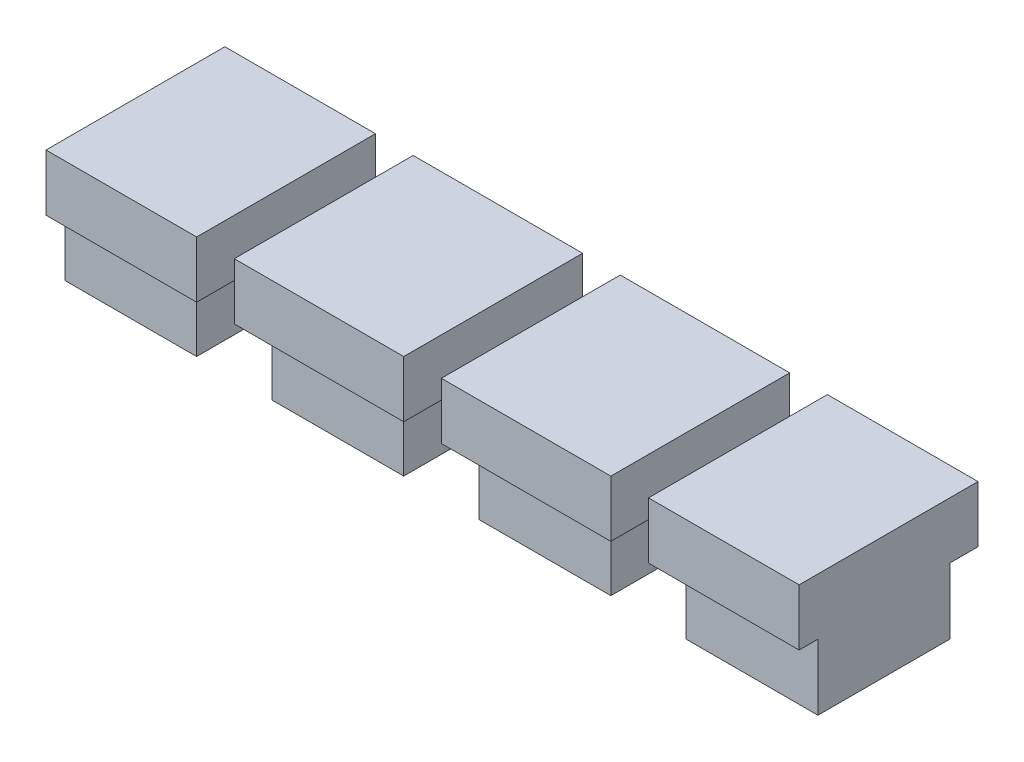
ISO-10303-21;
HEADER;
FILE_DESCRIPTION(('STEP AP214'),'2;1');
FILE_NAME('part.step','',(''),(''),'','','');
FILE_SCHEMA(('AUTOMOTIVE_DESIGN { 1 0 10303 214 1 1 1 1 }'));
ENDSEC;
DATA;
#1=APPLICATION_CONTEXT('core data for automotive mechanical design processes');
#2=APPLICATION_PROTOCOL_DEFINITION('international standard','automotive_design',2000,#1);
#3=PRODUCT_CONTEXT('',#1,'mechanical');
#4=PRODUCT('Part','Part','',(#3));
#5=PRODUCT_RELATED_PRODUCT_CATEGORY('part','',(#4));
#6=PRODUCT_DEFINITION_FORMATION('','',#4);
#7=PRODUCT_DEFINITION_CONTEXT('part definition',#1,'design');
#8=PRODUCT_DEFINITION('design','',#6,#7);
#9=PRODUCT_DEFINITION_SHAPE('','',#8);
#10=(LENGTH_UNIT() NAMED_UNIT(*) SI_UNIT(.MILLI.,.METRE.));
#11=(NAMED_UNIT(*) PLANE_ANGLE_UNIT() SI_UNIT($,.RADIAN.));
#12=(NAMED_UNIT(*) SI_UNIT($,.STERADIAN.) SOLID_ANGLE_UNIT());
#13=UNCERTAINTY_MEASURE_WITH_UNIT(LENGTH_MEASURE(1.E-05),#10,'distance_accuracy_value','');
#14=(GEOMETRIC_REPRESENTATION_CONTEXT(3) GLOBAL_UNCERTAINTY_ASSIGNED_CONTEXT((#13)) GLOBAL_UNIT_ASSIGNED_CONTEXT((#10,
#11,#12)) REPRESENTATION_CONTEXT('',''));
#15=CARTESIAN_POINT('',(0.,0.,0.));
#16=DIRECTION('',(0.,0.,1.));
#17=DIRECTION('',(1.,0.,0.));
#18=AXIS2_PLACEMENT_3D('',#15,#16,#17);
#19=CARTESIAN_POINT('',(0.,72.5,0.));
#20=DIRECTION('',(0.,1.,0.));
#21=DIRECTION('',(0.,0.,1.));
#22=AXIS2_PLACEMENT_3D('',#19,#20,#21);
#23=PLANE('',#22);
#24=DIRECTION('',(1.,0.,0.));
#25=VECTOR('',#24,1.);
#26=CARTESIAN_POINT('',(23.15,72.5,24.95));
#27=LINE('',#26,#25);
#28=CARTESIAN_POINT('',(15.15,72.5,24.95));
#29=VERTEX_POINT('',#28);
#30=CARTESIAN_POINT('',(23.15,72.5,24.95));
#31=VERTEX_POINT('',#30);
#32=EDGE_CURVE('E164',#29,#31,#27,.T.);
#33=ORIENTED_EDGE('',*,*,#32,.F.);
#34=DIRECTION('',(0.,0.,1.));
#35=VECTOR('',#34,1.);
#36=CARTESIAN_POINT('',(15.15,72.5,24.95));
#37=LINE('',#36,#35);
#38=CARTESIAN_POINT('',(15.15,72.5,23.95));
#39=VERTEX_POINT('',#38);
#40=EDGE_CURVE('E89',#39,#29,#37,.T.);
#41=ORIENTED_EDGE('',*,*,#40,.F.);
#42=DIRECTION('',(1.,0.,0.));
#43=VECTOR('',#42,1.);
#44=CARTESIAN_POINT('',(23.15,72.5,23.95));
#45=LINE('',#44,#43);
#46=CARTESIAN_POINT('',(22.15,72.5,23.95));
#47=VERTEX_POINT('',#46);
#48=EDGE_CURVE('E83',#39,#47,#45,.T.);
#49=ORIENTED_EDGE('',*,*,#48,.T.);
#50=DIRECTION('',(0.,0.,1.));
#51=VECTOR('',#50,1.);
#52=CARTESIAN_POINT('',(22.15,72.5,16.95));
#53=LINE('',#52,#51);
#54=CARTESIAN_POINT('',(22.15,72.5,16.95));
#55=VERTEX_POINT('',#54);
#56=EDGE_CURVE('E162',#55,#47,#53,.T.);
#57=ORIENTED_EDGE('',*,*,#56,.F.);
#58=DIRECTION('',(1.,0.,0.));
#59=VECTOR('',#58,1.);
#60=CARTESIAN_POINT('',(15.15,72.5,16.95));
#61=LINE('',#60,#59);
#62=CARTESIAN_POINT('',(15.15,72.5,16.95));
#63=VERTEX_POINT('',#62);
#64=EDGE_CURVE('E157',#63,#55,#61,.T.);
#65=ORIENTED_EDGE('',*,*,#64,.F.);
#66=CARTESIAN_POINT('',(15.15,72.5,15.45));
#67=VERTEX_POINT('',#66);
#68=EDGE_CURVE('E140',#67,#63,#37,.T.);
#69=ORIENTED_EDGE('',*,*,#68,.F.);
#70=DIRECTION('',(-1.,0.,0.));
#71=VECTOR('',#70,1.);
#72=CARTESIAN_POINT('',(22.4,72.5,15.45));
#73=LINE('',#72,#71);
#74=CARTESIAN_POINT('',(23.15,72.5,15.45));
#75=VERTEX_POINT('',#74);
#76=EDGE_CURVE('E154',#75,#67,#73,.T.);
#77=ORIENTED_EDGE('',*,*,#76,.F.);
#78=DIRECTION('',(0.,0.,-1.));
#79=VECTOR('',#78,1.);
#80=CARTESIAN_POINT('',(23.15,72.5,23.95));
#81=LINE('',#80,#79);
#82=EDGE_CURVE('E194',#31,#75,#81,.T.);
#83=ORIENTED_EDGE('',*,*,#82,.F.);
#84=EDGE_LOOP('',(#33,#41,#49,#57,#65,#69,#77,#83));
#85=FACE_BOUND('',#84,.T.);
#86=ADVANCED_FACE('F76',(#85),#23,.F.);
#87=CARTESIAN_POINT('',(22.4,72.5,15.45));
#88=DIRECTION('',(0.,0.,-1.));
#89=DIRECTION('',(-1.,0.,0.));
#90=AXIS2_PLACEMENT_3D('',#87,#88,#89);
#91=PLANE('',#90);
#92=DIRECTION('',(0.,-1.,0.));
#93=VECTOR('',#92,1.);
#94=CARTESIAN_POINT('',(15.15,99.5,15.45));
#95=LINE('',#94,#93);
#96=CARTESIAN_POINT('',(15.15,75.5,15.45));
#97=VERTEX_POINT('',#96);
#98=EDGE_CURVE('E137',#97,#67,#95,.T.);
#99=ORIENTED_EDGE('',*,*,#98,.F.);
#100=DIRECTION('',(-1.,0.,0.));
#101=VECTOR('',#100,1.);
#102=CARTESIAN_POINT('',(0.,75.5,15.45));
#103=LINE('',#102,#101);
#104=CARTESIAN_POINT('',(23.15,75.5,15.45));
#105=VERTEX_POINT('',#104);
#106=EDGE_CURVE('E160',#105,#97,#103,.T.);
#107=ORIENTED_EDGE('',*,*,#106,.F.);
#108=DIRECTION('',(0.,-1.,0.));
#109=VECTOR('',#108,1.);
#110=CARTESIAN_POINT('',(23.15,82.5,15.45));
#111=LINE('',#110,#109);
#112=EDGE_CURVE('E98',#105,#75,#111,.T.);
#113=ORIENTED_EDGE('',*,*,#112,.T.);
#114=ORIENTED_EDGE('',*,*,#76,.T.);
#115=EDGE_LOOP('',(#99,#107,#113,#114));
#116=FACE_BOUND('',#115,.T.);
#117=ADVANCED_FACE('F159',(#116),#91,.T.);
#118=CARTESIAN_POINT('',(0.,75.5,0.));
#119=DIRECTION('',(0.,1.,0.));
#120=DIRECTION('',(0.,0.,1.));
#121=AXIS2_PLACEMENT_3D('',#118,#119,#120);
#122=PLANE('',#121);
#123=DIRECTION('',(0.,0.,-1.));
#124=VECTOR('',#123,1.);
#125=CARTESIAN_POINT('',(15.15,75.5,0.));
#126=LINE('',#125,#124);
#127=CARTESIAN_POINT('',(15.15,75.5,24.95));
#128=VERTEX_POINT('',#127);
#129=EDGE_CURVE('E143',#128,#97,#126,.T.);
#130=ORIENTED_EDGE('',*,*,#129,.F.);
#131=DIRECTION('',(-1.,0.,0.));
#132=VECTOR('',#131,1.);
#133=CARTESIAN_POINT('',(23.15,75.5,24.95));
#134=LINE('',#133,#132);
#135=CARTESIAN_POINT('',(23.15,75.5,24.95));
#136=VERTEX_POINT('',#135);
#137=EDGE_CURVE('E241',#136,#128,#134,.T.);
#138=ORIENTED_EDGE('',*,*,#137,.F.);
#139=DIRECTION('',(0.,0.,1.));
#140=VECTOR('',#139,1.);
#141=CARTESIAN_POINT('',(23.15,75.5,0.));
#142=LINE('',#141,#140);
#143=EDGE_CURVE('E182',#105,#136,#142,.T.);
#144=ORIENTED_EDGE('',*,*,#143,.F.);
#145=ORIENTED_EDGE('',*,*,#106,.T.);
#146=EDGE_LOOP('',(#130,#138,#144,#145));
#147=FACE_BOUND('',#146,.T.);
#148=ADVANCED_FACE('F216',(#147),#122,.T.);
#149=CARTESIAN_POINT('',(22.15,72.5,16.95));
#150=DIRECTION('',(1.,0.,0.));
#151=DIRECTION('',(0.,0.,-1.));
#152=AXIS2_PLACEMENT_3D('',#149,#150,#151);
#153=PLANE('',#152);
#154=DIRECTION('',(0.,0.,1.));
#155=VECTOR('',#154,1.);
#156=CARTESIAN_POINT('',(22.15,69.,16.95));
#157=LINE('',#156,#155);
#158=CARTESIAN_POINT('',(22.15,69.,16.95));
#159=VERTEX_POINT('',#158);
#160=CARTESIAN_POINT('',(22.15,69.,23.95));
#161=VERTEX_POINT('',#160);
#162=EDGE_CURVE('E174',#159,#161,#157,.T.);
#163=ORIENTED_EDGE('',*,*,#162,.F.);
#164=DIRECTION('',(0.,-1.,0.));
#165=VECTOR('',#164,1.);
#166=CARTESIAN_POINT('',(22.15,72.5,16.95));
#167=LINE('',#166,#165);
#168=EDGE_CURVE('E177',#55,#159,#167,.T.);
#169=ORIENTED_EDGE('',*,*,#168,.F.);
#170=ORIENTED_EDGE('',*,*,#56,.T.);
#171=DIRECTION('',(0.,-1.,0.));
#172=VECTOR('',#171,1.);
#173=CARTESIAN_POINT('',(22.15,72.5,23.95));
#174=LINE('',#173,#172);
#175=EDGE_CURVE('E169',#47,#161,#174,.T.);
#176=ORIENTED_EDGE('',*,*,#175,.T.);
#177=EDGE_LOOP('',(#163,#169,#170,#176));
#178=FACE_BOUND('',#177,.T.);
#179=ADVANCED_FACE('F206',(#178),#153,.T.);
#180=CARTESIAN_POINT('',(15.15,72.5,16.95));
#181=DIRECTION('',(0.,0.,-1.));
#182=DIRECTION('',(-1.,0.,0.));
#183=AXIS2_PLACEMENT_3D('',#180,#181,#182);
#184=PLANE('',#183);
#185=DIRECTION('',(1.,0.,0.));
#186=VECTOR('',#185,1.);
#187=CARTESIAN_POINT('',(15.15,69.,16.95));
#188=LINE('',#187,#186);
#189=CARTESIAN_POINT('',(15.15,69.,16.95));
#190=VERTEX_POINT('',#189);
#191=EDGE_CURVE('E179',#190,#159,#188,.T.);
#192=ORIENTED_EDGE('',*,*,#191,.F.);
#193=DIRECTION('',(0.,-1.,0.));
#194=VECTOR('',#193,1.);
#195=CARTESIAN_POINT('',(15.15,72.5,16.95));
#196=LINE('',#195,#194);
#197=EDGE_CURVE('E175',#63,#190,#196,.T.);
#198=ORIENTED_EDGE('',*,*,#197,.F.);
#199=ORIENTED_EDGE('',*,*,#64,.T.);
#200=ORIENTED_EDGE('',*,*,#168,.T.);
#201=EDGE_LOOP('',(#192,#198,#199,#200));
#202=FACE_BOUND('',#201,.T.);
#203=ADVANCED_FACE('F208',(#202),#184,.T.);
#204=CARTESIAN_POINT('',(15.15,72.5,16.95));
#205=DIRECTION('',(-1.,0.,0.));
#206=DIRECTION('',(0.,0.,1.));
#207=AXIS2_PLACEMENT_3D('',#204,#205,#206);
#208=PLANE('',#207);
#209=DIRECTION('',(0.,0.,-1.));
#210=VECTOR('',#209,1.);
#211=CARTESIAN_POINT('',(15.15,69.,16.95));
#212=LINE('',#211,#210);
#213=CARTESIAN_POINT('',(15.15,69.,23.95));
#214=VERTEX_POINT('',#213);
#215=EDGE_CURVE('E183',#214,#190,#212,.T.);
#216=ORIENTED_EDGE('',*,*,#215,.F.);
#217=DIRECTION('',(0.,-1.,0.));
#218=VECTOR('',#217,1.);
#219=CARTESIAN_POINT('',(15.15,72.5,23.95));
#220=LINE('',#219,#218);
#221=EDGE_CURVE('E171',#39,#214,#220,.T.);
#222=ORIENTED_EDGE('',*,*,#221,.F.);
#223=ORIENTED_EDGE('',*,*,#40,.T.);
#224=DIRECTION('',(0.,1.,0.));
#225=VECTOR('',#224,1.);
#226=CARTESIAN_POINT('',(15.15,0.,24.95));
#227=LINE('',#226,#225);
#228=EDGE_CURVE('E13',#29,#128,#227,.T.);
#229=ORIENTED_EDGE('',*,*,#228,.T.);
#230=ORIENTED_EDGE('',*,*,#129,.T.);
#231=ORIENTED_EDGE('',*,*,#98,.T.);
#232=ORIENTED_EDGE('',*,*,#68,.T.);
#233=ORIENTED_EDGE('',*,*,#197,.T.);
#234=EDGE_LOOP('',(#216,#222,#223,#229,#230,#231,#232,#233));
#235=FACE_BOUND('',#234,.T.);
#236=ADVANCED_FACE('F139',(#235),#208,.T.);
#237=CARTESIAN_POINT('',(15.15,72.5,23.95));
#238=DIRECTION('',(0.,0.,1.));
#239=DIRECTION('',(1.,0.,0.));
#240=AXIS2_PLACEMENT_3D('',#237,#238,#239);
#241=PLANE('',#240);
#242=ORIENTED_EDGE('',*,*,#48,.F.);
#243=ORIENTED_EDGE('',*,*,#221,.T.);
#244=DIRECTION('',(-1.,0.,0.));
#245=VECTOR('',#244,1.);
#246=CARTESIAN_POINT('',(15.15,69.,23.95));
#247=LINE('',#246,#245);
#248=EDGE_CURVE('E186',#161,#214,#247,.T.);
#249=ORIENTED_EDGE('',*,*,#248,.F.);
#250=ORIENTED_EDGE('',*,*,#175,.F.);
#251=EDGE_LOOP('',(#242,#243,#249,#250));
#252=FACE_BOUND('',#251,.T.);
#253=ADVANCED_FACE('F199',(#252),#241,.T.);
#254=CARTESIAN_POINT('',(0.,69.,0.));
#255=DIRECTION('',(0.,1.,0.));
#256=DIRECTION('',(0.,0.,1.));
#257=AXIS2_PLACEMENT_3D('',#254,#255,#256);
#258=PLANE('',#257);
#259=ORIENTED_EDGE('',*,*,#162,.T.);
#260=ORIENTED_EDGE('',*,*,#248,.T.);
#261=ORIENTED_EDGE('',*,*,#215,.T.);
#262=ORIENTED_EDGE('',*,*,#191,.T.);
#263=EDGE_LOOP('',(#259,#260,#261,#262));
#264=FACE_BOUND('',#263,.T.);
#265=ADVANCED_FACE('F203',(#264),#258,.F.);
#266=CARTESIAN_POINT('',(23.15,82.5,23.95));
#267=DIRECTION('',(-1.,0.,0.));
#268=DIRECTION('',(0.,0.,1.));
#269=AXIS2_PLACEMENT_3D('',#266,#267,#268);
#270=PLANE('',#269);
#271=ORIENTED_EDGE('',*,*,#143,.T.);
#272=DIRECTION('',(0.,1.,0.));
#273=VECTOR('',#272,1.);
#274=CARTESIAN_POINT('',(23.15,72.5,24.95));
#275=LINE('',#274,#273);
#276=EDGE_CURVE('E242',#31,#136,#275,.T.);
#277=ORIENTED_EDGE('',*,*,#276,.F.);
#278=ORIENTED_EDGE('',*,*,#82,.T.);
#279=ORIENTED_EDGE('',*,*,#112,.F.);
#280=EDGE_LOOP('',(#271,#277,#278,#279));
#281=FACE_BOUND('',#280,.T.);
#282=ADVANCED_FACE('F231',(#281),#270,.F.);
#283=CARTESIAN_POINT('',(0.,0.,24.95));
#284=DIRECTION('',(0.,0.,1.));
#285=DIRECTION('',(1.,0.,0.));
#286=AXIS2_PLACEMENT_3D('',#283,#284,#285);
#287=PLANE('',#286);
#288=ORIENTED_EDGE('',*,*,#228,.F.);
#289=ORIENTED_EDGE('',*,*,#32,.T.);
#290=ORIENTED_EDGE('',*,*,#276,.T.);
#291=ORIENTED_EDGE('',*,*,#137,.T.);
#292=EDGE_LOOP('',(#288,#289,#290,#291));
#293=FACE_BOUND('',#292,.T.);
#294=ADVANCED_FACE('F232',(#293),#287,.T.);
#295=CLOSED_SHELL('',(#86,#117,#148,#179,#203,#236,#253,#265,#282,#294));
#296=MANIFOLD_SOLID_BREP('B2',#295);
#297=CARTESIAN_POINT('',(48.15,72.5,16.95));
#298=DIRECTION('',(0.,0.,-1.));
#299=DIRECTION('',(-1.,0.,0.));
#300=AXIS2_PLACEMENT_3D('',#297,#298,#299);
#301=PLANE('',#300);
#302=DIRECTION('',(1.,0.,0.));
#303=VECTOR('',#302,1.);
#304=CARTESIAN_POINT('',(48.15,69.,16.95));
#305=LINE('',#304,#303);
#306=CARTESIAN_POINT('',(48.15,69.,16.95));
#307=VERTEX_POINT('',#306);
#308=CARTESIAN_POINT('',(55.15,69.,16.95));
#309=VERTEX_POINT('',#308);
#310=EDGE_CURVE('E539',#307,#309,#305,.T.);
#311=ORIENTED_EDGE('',*,*,#310,.F.);
#312=DIRECTION('',(0.,-1.,0.));
#313=VECTOR('',#312,1.);
#314=CARTESIAN_POINT('',(48.15,72.5,16.95));
#315=LINE('',#314,#313);
#316=CARTESIAN_POINT('',(48.15,72.5,16.95));
#317=VERTEX_POINT('',#316);
#318=EDGE_CURVE('E535',#317,#307,#315,.T.);
#319=ORIENTED_EDGE('',*,*,#318,.F.);
#320=DIRECTION('',(1.,0.,0.));
#321=VECTOR('',#320,1.);
#322=CARTESIAN_POINT('',(48.15,72.5,16.95));
#323=LINE('',#322,#321);
#324=CARTESIAN_POINT('',(55.15,72.5,16.95));
#325=VERTEX_POINT('',#324);
#326=EDGE_CURVE('E516',#317,#325,#323,.T.);
#327=ORIENTED_EDGE('',*,*,#326,.T.);
#328=DIRECTION('',(0.,-1.,0.));
#329=VECTOR('',#328,1.);
#330=CARTESIAN_POINT('',(55.15,72.5,16.95));
#331=LINE('',#330,#329);
#332=EDGE_CURVE('E532',#325,#309,#331,.T.);
#333=ORIENTED_EDGE('',*,*,#332,.T.);
#334=EDGE_LOOP('',(#311,#319,#327,#333));
#335=FACE_BOUND('',#334,.T.);
#336=ADVANCED_FACE('F430',(#335),#301,.T.);
#337=CARTESIAN_POINT('',(55.15,72.5,16.95));
#338=DIRECTION('',(1.,0.,0.));
#339=DIRECTION('',(0.,0.,-1.));
#340=AXIS2_PLACEMENT_3D('',#337,#338,#339);
#341=PLANE('',#340);
#342=DIRECTION('',(0.,0.,1.));
#343=VECTOR('',#342,1.);
#344=CARTESIAN_POINT('',(55.15,69.,16.95));
#345=LINE('',#344,#343);
#346=CARTESIAN_POINT('',(55.15,69.,23.95));
#347=VERTEX_POINT('',#346);
#348=EDGE_CURVE('E531',#309,#347,#345,.T.);
#349=ORIENTED_EDGE('',*,*,#348,.F.);
#350=ORIENTED_EDGE('',*,*,#332,.F.);
#351=DIRECTION('',(0.,0.,-1.));
#352=VECTOR('',#351,1.);
#353=CARTESIAN_POINT('',(55.15,72.5,24.95));
#354=LINE('',#353,#352);
#355=CARTESIAN_POINT('',(55.15,72.5,15.45));
#356=VERTEX_POINT('',#355);
#357=EDGE_CURVE('E509',#325,#356,#354,.T.);
#358=ORIENTED_EDGE('',*,*,#357,.T.);
#359=DIRECTION('',(0.,-1.,0.));
#360=VECTOR('',#359,1.);
#361=CARTESIAN_POINT('',(55.15,99.5,15.45));
#362=LINE('',#361,#360);
#363=CARTESIAN_POINT('',(55.15,75.5,15.45));
#364=VERTEX_POINT('',#363);
#365=EDGE_CURVE('E508',#364,#356,#362,.T.);
#366=ORIENTED_EDGE('',*,*,#365,.F.);
#367=DIRECTION('',(0.,0.,1.));
#368=VECTOR('',#367,1.);
#369=CARTESIAN_POINT('',(55.15,75.5,0.));
#370=LINE('',#369,#368);
#371=CARTESIAN_POINT('',(55.15,75.5,24.95));
#372=VERTEX_POINT('',#371);
#373=EDGE_CURVE('E445',#364,#372,#370,.T.);
#374=ORIENTED_EDGE('',*,*,#373,.T.);
#375=DIRECTION('',(0.,1.,0.));
#376=VECTOR('',#375,1.);
#377=CARTESIAN_POINT('',(55.15,0.,24.95));
#378=LINE('',#377,#376);
#379=CARTESIAN_POINT('',(55.15,72.5,24.95));
#380=VERTEX_POINT('',#379);
#381=EDGE_CURVE('E74',#380,#372,#378,.T.);
#382=ORIENTED_EDGE('',*,*,#381,.F.);
#383=CARTESIAN_POINT('',(55.15,72.5,23.95));
#384=VERTEX_POINT('',#383);
#385=EDGE_CURVE('E495',#380,#384,#354,.T.);
#386=ORIENTED_EDGE('',*,*,#385,.T.);
#387=DIRECTION('',(0.,-1.,0.));
#388=VECTOR('',#387,1.);
#389=CARTESIAN_POINT('',(55.15,72.5,23.95));
#390=LINE('',#389,#388);
#391=EDGE_CURVE('E529',#384,#347,#390,.T.);
#392=ORIENTED_EDGE('',*,*,#391,.T.);
#393=EDGE_LOOP('',(#349,#350,#358,#366,#374,#382,#386,#392));
#394=FACE_BOUND('',#393,.T.);
#395=ADVANCED_FACE('F494',(#394),#341,.T.);
#396=CARTESIAN_POINT('',(0.,69.,0.));
#397=DIRECTION('',(0.,1.,0.));
#398=DIRECTION('',(0.,0.,1.));
#399=AXIS2_PLACEMENT_3D('',#396,#397,#398);
#400=PLANE('',#399);
#401=ORIENTED_EDGE('',*,*,#348,.T.);
#402=DIRECTION('',(-1.,0.,0.));
#403=VECTOR('',#402,1.);
#404=CARTESIAN_POINT('',(48.15,69.,23.95));
#405=LINE('',#404,#403);
#406=CARTESIAN_POINT('',(48.15,69.,23.95));
#407=VERTEX_POINT('',#406);
#408=EDGE_CURVE('E545',#347,#407,#405,.T.);
#409=ORIENTED_EDGE('',*,*,#408,.T.);
#410=DIRECTION('',(0.,0.,-1.));
#411=VECTOR('',#410,1.);
#412=CARTESIAN_POINT('',(48.15,69.,16.95));
#413=LINE('',#412,#411);
#414=EDGE_CURVE('E542',#407,#307,#413,.T.);
#415=ORIENTED_EDGE('',*,*,#414,.T.);
#416=ORIENTED_EDGE('',*,*,#310,.T.);
#417=EDGE_LOOP('',(#401,#409,#415,#416));
#418=FACE_BOUND('',#417,.T.);
#419=ADVANCED_FACE('F582',(#418),#400,.F.);
#420=CARTESIAN_POINT('',(48.15,72.5,16.95));
#421=DIRECTION('',(-1.,0.,0.));
#422=DIRECTION('',(0.,0.,1.));
#423=AXIS2_PLACEMENT_3D('',#420,#421,#422);
#424=PLANE('',#423);
#425=ORIENTED_EDGE('',*,*,#414,.F.);
#426=DIRECTION('',(0.,-1.,0.));
#427=VECTOR('',#426,1.);
#428=CARTESIAN_POINT('',(48.15,72.5,23.95));
#429=LINE('',#428,#427);
#430=CARTESIAN_POINT('',(48.15,72.5,23.95));
#431=VERTEX_POINT('',#430);
#432=EDGE_CURVE('E528',#431,#407,#429,.T.);
#433=ORIENTED_EDGE('',*,*,#432,.F.);
#434=DIRECTION('',(0.,0.,-1.));
#435=VECTOR('',#434,1.);
#436=CARTESIAN_POINT('',(48.15,72.5,16.95));
#437=LINE('',#436,#435);
#438=EDGE_CURVE('E537',#431,#317,#437,.T.);
#439=ORIENTED_EDGE('',*,*,#438,.T.);
#440=ORIENTED_EDGE('',*,*,#318,.T.);
#441=EDGE_LOOP('',(#425,#433,#439,#440));
#442=FACE_BOUND('',#441,.T.);
#443=ADVANCED_FACE('F573',(#442),#424,.T.);
#444=CARTESIAN_POINT('',(15.15,72.5,23.95));
#445=DIRECTION('',(0.,0.,1.));
#446=DIRECTION('',(1.,0.,0.));
#447=AXIS2_PLACEMENT_3D('',#444,#445,#446);
#448=PLANE('',#447);
#449=DIRECTION('',(1.,0.,0.));
#450=VECTOR('',#449,1.);
#451=CARTESIAN_POINT('',(47.15,72.5,23.95));
#452=LINE('',#451,#450);
#453=EDGE_CURVE('E438',#431,#384,#452,.T.);
#454=ORIENTED_EDGE('',*,*,#453,.F.);
#455=ORIENTED_EDGE('',*,*,#432,.T.);
#456=ORIENTED_EDGE('',*,*,#408,.F.);
#457=ORIENTED_EDGE('',*,*,#391,.F.);
#458=EDGE_LOOP('',(#454,#455,#456,#457));
#459=FACE_BOUND('',#458,.T.);
#460=ADVANCED_FACE('F567',(#459),#448,.T.);
#461=CARTESIAN_POINT('',(0.,75.5,0.));
#462=DIRECTION('',(0.,1.,0.));
#463=DIRECTION('',(0.,0.,1.));
#464=AXIS2_PLACEMENT_3D('',#461,#462,#463);
#465=PLANE('',#464);
#466=ORIENTED_EDGE('',*,*,#373,.F.);
#467=DIRECTION('',(-1.,0.,0.));
#468=VECTOR('',#467,1.);
#469=CARTESIAN_POINT('',(0.,75.5,15.45));
#470=LINE('',#469,#468);
#471=CARTESIAN_POINT('',(47.15,75.5,15.45));
#472=VERTEX_POINT('',#471);
#473=EDGE_CURVE('E452',#364,#472,#470,.T.);
#474=ORIENTED_EDGE('',*,*,#473,.T.);
#475=DIRECTION('',(0.,0.,1.));
#476=VECTOR('',#475,1.);
#477=CARTESIAN_POINT('',(47.15,75.5,0.));
#478=LINE('',#477,#476);
#479=CARTESIAN_POINT('',(47.15,75.5,24.95));
#480=VERTEX_POINT('',#479);
#481=EDGE_CURVE('E526',#472,#480,#478,.T.);
#482=ORIENTED_EDGE('',*,*,#481,.T.);
#483=DIRECTION('',(-1.,0.,0.));
#484=VECTOR('',#483,1.);
#485=CARTESIAN_POINT('',(47.15,75.5,24.95));
#486=LINE('',#485,#484);
#487=EDGE_CURVE('E514',#372,#480,#486,.T.);
#488=ORIENTED_EDGE('',*,*,#487,.F.);
#489=EDGE_LOOP('',(#466,#474,#482,#488));
#490=FACE_BOUND('',#489,.T.);
#491=ADVANCED_FACE('F565',(#490),#465,.T.);
#492=CARTESIAN_POINT('',(56.65,72.5,15.45));
#493=DIRECTION('',(0.,0.,-1.));
#494=DIRECTION('',(-1.,0.,0.));
#495=AXIS2_PLACEMENT_3D('',#492,#493,#494);
#496=PLANE('',#495);
#497=ORIENTED_EDGE('',*,*,#365,.T.);
#498=DIRECTION('',(-1.,0.,0.));
#499=VECTOR('',#498,1.);
#500=CARTESIAN_POINT('',(56.65,72.5,15.45));
#501=LINE('',#500,#499);
#502=CARTESIAN_POINT('',(47.15,72.5,15.45));
#503=VERTEX_POINT('',#502);
#504=EDGE_CURVE('E523',#356,#503,#501,.T.);
#505=ORIENTED_EDGE('',*,*,#504,.T.);
#506=DIRECTION('',(0.,-1.,0.));
#507=VECTOR('',#506,1.);
#508=CARTESIAN_POINT('',(47.15,82.5,15.45));
#509=LINE('',#508,#507);
#510=EDGE_CURVE('E522',#472,#503,#509,.T.);
#511=ORIENTED_EDGE('',*,*,#510,.F.);
#512=ORIENTED_EDGE('',*,*,#473,.F.);
#513=EDGE_LOOP('',(#497,#505,#511,#512));
#514=FACE_BOUND('',#513,.T.);
#515=ADVANCED_FACE('F563',(#514),#496,.T.);
#516=CARTESIAN_POINT('',(0.,72.5,0.));
#517=DIRECTION('',(0.,1.,0.));
#518=DIRECTION('',(0.,0.,1.));
#519=AXIS2_PLACEMENT_3D('',#516,#517,#518);
#520=PLANE('',#519);
#521=ORIENTED_EDGE('',*,*,#504,.F.);
#522=ORIENTED_EDGE('',*,*,#357,.F.);
#523=ORIENTED_EDGE('',*,*,#326,.F.);
#524=ORIENTED_EDGE('',*,*,#438,.F.);
#525=ORIENTED_EDGE('',*,*,#453,.T.);
#526=ORIENTED_EDGE('',*,*,#385,.F.);
#527=DIRECTION('',(1.,0.,0.));
#528=VECTOR('',#527,1.);
#529=CARTESIAN_POINT('',(47.15,72.5,24.95));
#530=LINE('',#529,#528);
#531=CARTESIAN_POINT('',(47.15,72.5,24.95));
#532=VERTEX_POINT('',#531);
#533=EDGE_CURVE('E505',#532,#380,#530,.T.);
#534=ORIENTED_EDGE('',*,*,#533,.F.);
#535=DIRECTION('',(0.,0.,-1.));
#536=VECTOR('',#535,1.);
#537=CARTESIAN_POINT('',(47.15,72.5,23.95));
#538=LINE('',#537,#536);
#539=EDGE_CURVE('E525',#532,#503,#538,.T.);
#540=ORIENTED_EDGE('',*,*,#539,.T.);
#541=EDGE_LOOP('',(#521,#522,#523,#524,#525,#526,#534,#540));
#542=FACE_BOUND('',#541,.T.);
#543=ADVANCED_FACE('F432',(#542),#520,.F.);
#544=CARTESIAN_POINT('',(47.15,82.5,23.95));
#545=DIRECTION('',(-1.,0.,0.));
#546=DIRECTION('',(0.,0.,1.));
#547=AXIS2_PLACEMENT_3D('',#544,#545,#546);
#548=PLANE('',#547);
#549=ORIENTED_EDGE('',*,*,#510,.T.);
#550=ORIENTED_EDGE('',*,*,#539,.F.);
#551=DIRECTION('',(0.,-1.,0.));
#552=VECTOR('',#551,1.);
#553=CARTESIAN_POINT('',(47.15,72.5,24.95));
#554=LINE('',#553,#552);
#555=EDGE_CURVE('E513',#480,#532,#554,.T.);
#556=ORIENTED_EDGE('',*,*,#555,.F.);
#557=ORIENTED_EDGE('',*,*,#481,.F.);
#558=EDGE_LOOP('',(#549,#550,#556,#557));
#559=FACE_BOUND('',#558,.T.);
#560=ADVANCED_FACE('F558',(#559),#548,.T.);
#561=CARTESIAN_POINT('',(0.,0.,24.95));
#562=DIRECTION('',(0.,0.,-1.));
#563=DIRECTION('',(-1.,0.,0.));
#564=AXIS2_PLACEMENT_3D('',#561,#562,#563);
#565=PLANE('',#564);
#566=ORIENTED_EDGE('',*,*,#533,.T.);
#567=ORIENTED_EDGE('',*,*,#381,.T.);
#568=ORIENTED_EDGE('',*,*,#487,.T.);
#569=ORIENTED_EDGE('',*,*,#555,.T.);
#570=EDGE_LOOP('',(#566,#567,#568,#569));
#571=FACE_BOUND('',#570,.T.);
#572=ADVANCED_FACE('F511',(#571),#565,.F.);
#573=CLOSED_SHELL('',(#336,#395,#419,#443,#460,#491,#515,#543,#560,#572));
#574=MANIFOLD_SOLID_BREP('B7',#573);
#575=CARTESIAN_POINT('',(37.15,72.5,16.95));
#576=DIRECTION('',(0.,0.,-1.));
#577=DIRECTION('',(-1.,0.,0.));
#578=AXIS2_PLACEMENT_3D('',#575,#576,#577);
#579=PLANE('',#578);
#580=DIRECTION('',(1.,0.,0.));
#581=VECTOR('',#580,1.);
#582=CARTESIAN_POINT('',(37.15,69.,16.95));
#583=LINE('',#582,#581);
#584=CARTESIAN_POINT('',(37.15,69.,16.95));
#585=VERTEX_POINT('',#584);
#586=CARTESIAN_POINT('',(44.15,69.,16.95));
#587=VERTEX_POINT('',#586);
#588=EDGE_CURVE('E910',#585,#587,#583,.T.);
#589=ORIENTED_EDGE('',*,*,#588,.F.);
#590=DIRECTION('',(0.,-1.,0.));
#591=VECTOR('',#590,1.);
#592=CARTESIAN_POINT('',(37.15,72.5,16.95));
#593=LINE('',#592,#591);
#594=CARTESIAN_POINT('',(37.15,72.5,16.95));
#595=VERTEX_POINT('',#594);
#596=EDGE_CURVE('E847',#595,#585,#593,.T.);
#597=ORIENTED_EDGE('',*,*,#596,.F.);
#598=DIRECTION('',(1.,0.,0.));
#599=VECTOR('',#598,1.);
#600=CARTESIAN_POINT('',(37.15,72.5,16.95));
#601=LINE('',#600,#599);
#602=CARTESIAN_POINT('',(44.15,72.5,16.95));
#603=VERTEX_POINT('',#602);
#604=EDGE_CURVE('E889',#595,#603,#601,.T.);
#605=ORIENTED_EDGE('',*,*,#604,.T.);
#606=DIRECTION('',(0.,-1.,0.));
#607=VECTOR('',#606,1.);
#608=CARTESIAN_POINT('',(44.15,72.5,16.95));
#609=LINE('',#608,#607);
#610=EDGE_CURVE('E907',#603,#587,#609,.T.);
#611=ORIENTED_EDGE('',*,*,#610,.T.);
#612=EDGE_LOOP('',(#589,#597,#605,#611));
#613=FACE_BOUND('',#612,.T.);
#614=ADVANCED_FACE('F783',(#613),#579,.T.);
#615=CARTESIAN_POINT('',(44.15,72.5,16.95));
#616=DIRECTION('',(1.,0.,0.));
#617=DIRECTION('',(0.,0.,-1.));
#618=AXIS2_PLACEMENT_3D('',#615,#616,#617);
#619=PLANE('',#618);
#620=DIRECTION('',(0.,0.,1.));
#621=VECTOR('',#620,1.);
#622=CARTESIAN_POINT('',(44.15,69.,16.95));
#623=LINE('',#622,#621);
#624=CARTESIAN_POINT('',(44.15,69.,23.95));
#625=VERTEX_POINT('',#624);
#626=EDGE_CURVE('E900',#587,#625,#623,.T.);
#627=ORIENTED_EDGE('',*,*,#626,.F.);
#628=ORIENTED_EDGE('',*,*,#610,.F.);
#629=DIRECTION('',(0.,0.,1.));
#630=VECTOR('',#629,1.);
#631=CARTESIAN_POINT('',(44.15,72.5,16.95));
#632=LINE('',#631,#630);
#633=CARTESIAN_POINT('',(44.15,72.5,23.95));
#634=VERTEX_POINT('',#633);
#635=EDGE_CURVE('E901',#603,#634,#632,.T.);
#636=ORIENTED_EDGE('',*,*,#635,.T.);
#637=DIRECTION('',(0.,-1.,0.));
#638=VECTOR('',#637,1.);
#639=CARTESIAN_POINT('',(44.15,72.5,23.95));
#640=LINE('',#639,#638);
#641=EDGE_CURVE('E822',#634,#625,#640,.T.);
#642=ORIENTED_EDGE('',*,*,#641,.T.);
#643=EDGE_LOOP('',(#627,#628,#636,#642));
#644=FACE_BOUND('',#643,.T.);
#645=ADVANCED_FACE('F953',(#644),#619,.T.);
#646=CARTESIAN_POINT('',(0.,69.,0.));
#647=DIRECTION('',(0.,1.,0.));
#648=DIRECTION('',(0.,0.,1.));
#649=AXIS2_PLACEMENT_3D('',#646,#647,#648);
#650=PLANE('',#649);
#651=ORIENTED_EDGE('',*,*,#626,.T.);
#652=DIRECTION('',(-1.,0.,0.));
#653=VECTOR('',#652,1.);
#654=CARTESIAN_POINT('',(37.15,69.,23.95));
#655=LINE('',#654,#653);
#656=CARTESIAN_POINT('',(37.15,69.,23.95));
#657=VERTEX_POINT('',#656);
#658=EDGE_CURVE('E918',#625,#657,#655,.T.);
#659=ORIENTED_EDGE('',*,*,#658,.T.);
#660=DIRECTION('',(0.,0.,-1.));
#661=VECTOR('',#660,1.);
#662=CARTESIAN_POINT('',(37.15,69.,16.95));
#663=LINE('',#662,#661);
#664=EDGE_CURVE('E914',#657,#585,#663,.T.);
#665=ORIENTED_EDGE('',*,*,#664,.T.);
#666=ORIENTED_EDGE('',*,*,#588,.T.);
#667=EDGE_LOOP('',(#651,#659,#665,#666));
#668=FACE_BOUND('',#667,.T.);
#669=ADVANCED_FACE('F958',(#668),#650,.F.);
#670=CARTESIAN_POINT('',(37.15,72.5,16.95));
#671=DIRECTION('',(-1.,0.,0.));
#672=DIRECTION('',(0.,0.,1.));
#673=AXIS2_PLACEMENT_3D('',#670,#671,#672);
#674=PLANE('',#673);
#675=ORIENTED_EDGE('',*,*,#664,.F.);
#676=DIRECTION('',(0.,-1.,0.));
#677=VECTOR('',#676,1.);
#678=CARTESIAN_POINT('',(37.15,72.5,23.95));
#679=LINE('',#678,#677);
#680=CARTESIAN_POINT('',(37.15,72.5,23.95));
#681=VERTEX_POINT('',#680);
#682=EDGE_CURVE('E897',#681,#657,#679,.T.);
#683=ORIENTED_EDGE('',*,*,#682,.F.);
#684=DIRECTION('',(0.,0.,-1.));
#685=VECTOR('',#684,1.);
#686=CARTESIAN_POINT('',(37.15,72.5,16.95));
#687=LINE('',#686,#685);
#688=EDGE_CURVE('E906',#681,#595,#687,.T.);
#689=ORIENTED_EDGE('',*,*,#688,.T.);
#690=ORIENTED_EDGE('',*,*,#596,.T.);
#691=EDGE_LOOP('',(#675,#683,#689,#690));
#692=FACE_BOUND('',#691,.T.);
#693=ADVANCED_FACE('F951',(#692),#674,.T.);
#694=CARTESIAN_POINT('',(15.15,72.5,23.95));
#695=DIRECTION('',(0.,0.,1.));
#696=DIRECTION('',(1.,0.,0.));
#697=AXIS2_PLACEMENT_3D('',#694,#695,#696);
#698=PLANE('',#697);
#699=DIRECTION('',(1.,0.,0.));
#700=VECTOR('',#699,1.);
#701=CARTESIAN_POINT('',(36.15,72.5,23.95));
#702=LINE('',#701,#700);
#703=EDGE_CURVE('E428',#681,#634,#702,.T.);
#704=ORIENTED_EDGE('',*,*,#703,.F.);
#705=ORIENTED_EDGE('',*,*,#682,.T.);
#706=ORIENTED_EDGE('',*,*,#658,.F.);
#707=ORIENTED_EDGE('',*,*,#641,.F.);
#708=EDGE_LOOP('',(#704,#705,#706,#707));
#709=FACE_BOUND('',#708,.T.);
#710=ADVANCED_FACE('F945',(#709),#698,.T.);
#711=CARTESIAN_POINT('',(0.,75.5,0.));
#712=DIRECTION('',(0.,1.,0.));
#713=DIRECTION('',(0.,0.,1.));
#714=AXIS2_PLACEMENT_3D('',#711,#712,#713);
#715=PLANE('',#714);
#716=DIRECTION('',(-1.,0.,0.));
#717=VECTOR('',#716,1.);
#718=CARTESIAN_POINT('',(0.,75.5,15.45));
#719=LINE('',#718,#717);
#720=CARTESIAN_POINT('',(45.15,75.5,15.45));
#721=VERTEX_POINT('',#720);
#722=CARTESIAN_POINT('',(36.15,75.5,15.45));
#723=VERTEX_POINT('',#722);
#724=EDGE_CURVE('E894',#721,#723,#719,.T.);
#725=ORIENTED_EDGE('',*,*,#724,.T.);
#726=DIRECTION('',(0.,0.,1.));
#727=VECTOR('',#726,1.);
#728=CARTESIAN_POINT('',(36.15,75.5,0.));
#729=LINE('',#728,#727);
#730=CARTESIAN_POINT('',(36.15,75.5,24.95));
#731=VERTEX_POINT('',#730);
#732=EDGE_CURVE('E801',#723,#731,#729,.T.);
#733=ORIENTED_EDGE('',*,*,#732,.T.);
#734=DIRECTION('',(-1.,0.,0.));
#735=VECTOR('',#734,1.);
#736=CARTESIAN_POINT('',(36.15,75.5,24.95));
#737=LINE('',#736,#735);
#738=CARTESIAN_POINT('',(45.15,75.5,24.95));
#739=VERTEX_POINT('',#738);
#740=EDGE_CURVE('E882',#739,#731,#737,.T.);
#741=ORIENTED_EDGE('',*,*,#740,.F.);
#742=DIRECTION('',(0.,0.,1.));
#743=VECTOR('',#742,1.);
#744=CARTESIAN_POINT('',(45.15,75.5,0.));
#745=LINE('',#744,#743);
#746=EDGE_CURVE('E871',#721,#739,#745,.T.);
#747=ORIENTED_EDGE('',*,*,#746,.F.);
#748=EDGE_LOOP('',(#725,#733,#741,#747));
#749=FACE_BOUND('',#748,.T.);
#750=ADVANCED_FACE('F785',(#749),#715,.T.);
#751=CARTESIAN_POINT('',(44.4,72.5,15.45));
#752=DIRECTION('',(0.,0.,-1.));
#753=DIRECTION('',(-1.,0.,0.));
#754=AXIS2_PLACEMENT_3D('',#751,#752,#753);
#755=PLANE('',#754);
#756=DIRECTION('',(-1.,0.,0.));
#757=VECTOR('',#756,1.);
#758=CARTESIAN_POINT('',(44.4,72.5,15.45));
#759=LINE('',#758,#757);
#760=CARTESIAN_POINT('',(45.15,72.5,15.45));
#761=VERTEX_POINT('',#760);
#762=CARTESIAN_POINT('',(36.15,72.5,15.45));
#763=VERTEX_POINT('',#762);
#764=EDGE_CURVE('E891',#761,#763,#759,.T.);
#765=ORIENTED_EDGE('',*,*,#764,.T.);
#766=DIRECTION('',(0.,-1.,0.));
#767=VECTOR('',#766,1.);
#768=CARTESIAN_POINT('',(36.15,82.5,15.45));
#769=LINE('',#768,#767);
#770=EDGE_CURVE('E787',#723,#763,#769,.T.);
#771=ORIENTED_EDGE('',*,*,#770,.F.);
#772=ORIENTED_EDGE('',*,*,#724,.F.);
#773=DIRECTION('',(0.,-1.,0.));
#774=VECTOR('',#773,1.);
#775=CARTESIAN_POINT('',(45.15,82.5,15.45));
#776=LINE('',#775,#774);
#777=EDGE_CURVE('E872',#721,#761,#776,.T.);
#778=ORIENTED_EDGE('',*,*,#777,.T.);
#779=EDGE_LOOP('',(#765,#771,#772,#778));
#780=FACE_BOUND('',#779,.T.);
#781=ADVANCED_FACE('F941',(#780),#755,.T.);
#782=CARTESIAN_POINT('',(0.,72.5,0.));
#783=DIRECTION('',(0.,1.,0.));
#784=DIRECTION('',(0.,0.,1.));
#785=AXIS2_PLACEMENT_3D('',#782,#783,#784);
#786=PLANE('',#785);
#787=ORIENTED_EDGE('',*,*,#688,.F.);
#788=ORIENTED_EDGE('',*,*,#703,.T.);
#789=ORIENTED_EDGE('',*,*,#635,.F.);
#790=ORIENTED_EDGE('',*,*,#604,.F.);
#791=EDGE_LOOP('',(#787,#788,#789,#790));
#792=FACE_BOUND('',#791,.T.);
#793=DIRECTION('',(0.,0.,-1.));
#794=VECTOR('',#793,1.);
#795=CARTESIAN_POINT('',(36.15,72.5,23.95));
#796=LINE('',#795,#794);
#797=CARTESIAN_POINT('',(36.15,72.5,24.95));
#798=VERTEX_POINT('',#797);
#799=EDGE_CURVE('E862',#798,#763,#796,.T.);
#800=ORIENTED_EDGE('',*,*,#799,.T.);
#801=ORIENTED_EDGE('',*,*,#764,.F.);
#802=DIRECTION('',(0.,0.,-1.));
#803=VECTOR('',#802,1.);
#804=CARTESIAN_POINT('',(45.15,72.5,23.95));
#805=LINE('',#804,#803);
#806=CARTESIAN_POINT('',(45.15,72.5,24.95));
#807=VERTEX_POINT('',#806);
#808=EDGE_CURVE('E814',#807,#761,#805,.T.);
#809=ORIENTED_EDGE('',*,*,#808,.F.);
#810=DIRECTION('',(1.,0.,0.));
#811=VECTOR('',#810,1.);
#812=CARTESIAN_POINT('',(36.15,72.5,24.95));
#813=LINE('',#812,#811);
#814=EDGE_CURVE('E874',#798,#807,#813,.T.);
#815=ORIENTED_EDGE('',*,*,#814,.F.);
#816=EDGE_LOOP('',(#800,#801,#809,#815));
#817=FACE_BOUND('',#816,.T.);
#818=ADVANCED_FACE('F875',(#792,#817),#786,.F.);
#819=CARTESIAN_POINT('',(45.15,82.5,23.95));
#820=DIRECTION('',(-1.,0.,0.));
#821=DIRECTION('',(0.,0.,1.));
#822=AXIS2_PLACEMENT_3D('',#819,#820,#821);
#823=PLANE('',#822);
#824=ORIENTED_EDGE('',*,*,#746,.T.);
#825=DIRECTION('',(0.,1.,0.));
#826=VECTOR('',#825,1.);
#827=CARTESIAN_POINT('',(45.15,72.5,24.95));
#828=LINE('',#827,#826);
#829=EDGE_CURVE('E879',#807,#739,#828,.T.);
#830=ORIENTED_EDGE('',*,*,#829,.F.);
#831=ORIENTED_EDGE('',*,*,#808,.T.);
#832=ORIENTED_EDGE('',*,*,#777,.F.);
#833=EDGE_LOOP('',(#824,#830,#831,#832));
#834=FACE_BOUND('',#833,.T.);
#835=ADVANCED_FACE('F943',(#834),#823,.F.);
#836=CARTESIAN_POINT('',(36.15,82.5,23.95));
#837=DIRECTION('',(-1.,0.,0.));
#838=DIRECTION('',(0.,0.,1.));
#839=AXIS2_PLACEMENT_3D('',#836,#837,#838);
#840=PLANE('',#839);
#841=ORIENTED_EDGE('',*,*,#770,.T.);
#842=ORIENTED_EDGE('',*,*,#799,.F.);
#843=DIRECTION('',(0.,-1.,0.));
#844=VECTOR('',#843,1.);
#845=CARTESIAN_POINT('',(36.15,72.5,24.95));
#846=LINE('',#845,#844);
#847=EDGE_CURVE('E866',#731,#798,#846,.T.);
#848=ORIENTED_EDGE('',*,*,#847,.F.);
#849=ORIENTED_EDGE('',*,*,#732,.F.);
#850=EDGE_LOOP('',(#841,#842,#848,#849));
#851=FACE_BOUND('',#850,.T.);
#852=ADVANCED_FACE('F864',(#851),#840,.T.);
#853=CARTESIAN_POINT('',(0.,0.,24.95));
#854=DIRECTION('',(0.,0.,-1.));
#855=DIRECTION('',(-1.,0.,0.));
#856=AXIS2_PLACEMENT_3D('',#853,#854,#855);
#857=PLANE('',#856);
#858=ORIENTED_EDGE('',*,*,#847,.T.);
#859=ORIENTED_EDGE('',*,*,#814,.T.);
#860=ORIENTED_EDGE('',*,*,#829,.T.);
#861=ORIENTED_EDGE('',*,*,#740,.T.);
#862=EDGE_LOOP('',(#858,#859,#860,#861));
#863=FACE_BOUND('',#862,.T.);
#864=ADVANCED_FACE('F881',(#863),#857,.F.);
#865=CLOSED_SHELL('',(#614,#645,#669,#693,#710,#750,#781,#818,#835,#852,#864));
#866=MANIFOLD_SOLID_BREP('B68',#865);
#867=CARTESIAN_POINT('',(26.15,72.5,16.95));
#868=DIRECTION('',(0.,0.,-1.));
#869=DIRECTION('',(-1.,0.,0.));
#870=AXIS2_PLACEMENT_3D('',#867,#868,#869);
#871=PLANE('',#870);
#872=DIRECTION('',(1.,0.,0.));
#873=VECTOR('',#872,1.);
#874=CARTESIAN_POINT('',(26.15,69.,16.95));
#875=LINE('',#874,#873);
#876=CARTESIAN_POINT('',(26.15,69.,16.95));
#877=VERTEX_POINT('',#876);
#878=CARTESIAN_POINT('',(33.15,69.,16.95));
#879=VERTEX_POINT('',#878);
#880=EDGE_CURVE('E1275',#877,#879,#875,.T.);
#881=ORIENTED_EDGE('',*,*,#880,.F.);
#882=DIRECTION('',(0.,-1.,0.));
#883=VECTOR('',#882,1.);
#884=CARTESIAN_POINT('',(26.15,72.5,16.95));
#885=LINE('',#884,#883);
#886=CARTESIAN_POINT('',(26.15,72.5,16.95));
#887=VERTEX_POINT('',#886);
#888=EDGE_CURVE('E1292',#887,#877,#885,.T.);
#889=ORIENTED_EDGE('',*,*,#888,.F.);
#890=DIRECTION('',(1.,0.,0.));
#891=VECTOR('',#890,1.);
#892=CARTESIAN_POINT('',(26.15,72.5,16.95));
#893=LINE('',#892,#891);
#894=CARTESIAN_POINT('',(33.15,72.5,16.95));
#895=VERTEX_POINT('',#894);
#896=EDGE_CURVE('E1278',#887,#895,#893,.T.);
#897=ORIENTED_EDGE('',*,*,#896,.T.);
#898=DIRECTION('',(0.,-1.,0.));
#899=VECTOR('',#898,1.);
#900=CARTESIAN_POINT('',(33.15,72.5,16.95));
#901=LINE('',#900,#899);
#902=EDGE_CURVE('E1289',#895,#879,#901,.T.);
#903=ORIENTED_EDGE('',*,*,#902,.T.);
#904=EDGE_LOOP('',(#881,#889,#897,#903));
#905=FACE_BOUND('',#904,.T.);
#906=ADVANCED_FACE('F1166',(#905),#871,.T.);
#907=CARTESIAN_POINT('',(33.15,72.5,16.95));
#908=DIRECTION('',(1.,0.,0.));
#909=DIRECTION('',(0.,0.,-1.));
#910=AXIS2_PLACEMENT_3D('',#907,#908,#909);
#911=PLANE('',#910);
#912=DIRECTION('',(0.,0.,1.));
#913=VECTOR('',#912,1.);
#914=CARTESIAN_POINT('',(33.15,69.,16.95));
#915=LINE('',#914,#913);
#916=CARTESIAN_POINT('',(33.15,69.,23.95));
#917=VERTEX_POINT('',#916);
#918=EDGE_CURVE('E1271',#879,#917,#915,.T.);
#919=ORIENTED_EDGE('',*,*,#918,.F.);
#920=ORIENTED_EDGE('',*,*,#902,.F.);
#921=DIRECTION('',(0.,0.,1.));
#922=VECTOR('',#921,1.);
#923=CARTESIAN_POINT('',(33.15,72.5,16.95));
#924=LINE('',#923,#922);
#925=CARTESIAN_POINT('',(33.15,72.5,23.95));
#926=VERTEX_POINT('',#925);
#927=EDGE_CURVE('E1272',#895,#926,#924,.T.);
#928=ORIENTED_EDGE('',*,*,#927,.T.);
#929=DIRECTION('',(0.,-1.,0.));
#930=VECTOR('',#929,1.);
#931=CARTESIAN_POINT('',(33.15,72.5,23.95));
#932=LINE('',#931,#930);
#933=EDGE_CURVE('E1190',#926,#917,#932,.T.);
#934=ORIENTED_EDGE('',*,*,#933,.T.);
#935=EDGE_LOOP('',(#919,#920,#928,#934));
#936=FACE_BOUND('',#935,.T.);
#937=ADVANCED_FACE('F1313',(#936),#911,.T.);
#938=CARTESIAN_POINT('',(0.,69.,0.));
#939=DIRECTION('',(0.,1.,0.));
#940=DIRECTION('',(0.,0.,1.));
#941=AXIS2_PLACEMENT_3D('',#938,#939,#940);
#942=PLANE('',#941);
#943=ORIENTED_EDGE('',*,*,#918,.T.);
#944=DIRECTION('',(-1.,0.,0.));
#945=VECTOR('',#944,1.);
#946=CARTESIAN_POINT('',(26.15,69.,23.95));
#947=LINE('',#946,#945);
#948=CARTESIAN_POINT('',(26.15,69.,23.95));
#949=VERTEX_POINT('',#948);
#950=EDGE_CURVE('E1283',#917,#949,#947,.T.);
#951=ORIENTED_EDGE('',*,*,#950,.T.);
#952=DIRECTION('',(0.,0.,-1.));
#953=VECTOR('',#952,1.);
#954=CARTESIAN_POINT('',(26.15,69.,16.95));
#955=LINE('',#954,#953);
#956=EDGE_CURVE('E1182',#949,#877,#955,.T.);
#957=ORIENTED_EDGE('',*,*,#956,.T.);
#958=ORIENTED_EDGE('',*,*,#880,.T.);
#959=EDGE_LOOP('',(#943,#951,#957,#958));
#960=FACE_BOUND('',#959,.T.);
#961=ADVANCED_FACE('F1319',(#960),#942,.F.);
#962=CARTESIAN_POINT('',(26.15,72.5,16.95));
#963=DIRECTION('',(-1.,0.,0.));
#964=DIRECTION('',(0.,0.,1.));
#965=AXIS2_PLACEMENT_3D('',#962,#963,#964);
#966=PLANE('',#965);
#967=ORIENTED_EDGE('',*,*,#956,.F.);
#968=DIRECTION('',(0.,-1.,0.));
#969=VECTOR('',#968,1.);
#970=CARTESIAN_POINT('',(26.15,72.5,23.95));
#971=LINE('',#970,#969);
#972=CARTESIAN_POINT('',(26.15,72.5,23.95));
#973=VERTEX_POINT('',#972);
#974=EDGE_CURVE('E1294',#973,#949,#971,.T.);
#975=ORIENTED_EDGE('',*,*,#974,.F.);
#976=DIRECTION('',(0.,0.,-1.));
#977=VECTOR('',#976,1.);
#978=CARTESIAN_POINT('',(26.15,72.5,16.95));
#979=LINE('',#978,#977);
#980=EDGE_CURVE('E1274',#973,#887,#979,.T.);
#981=ORIENTED_EDGE('',*,*,#980,.T.);
#982=ORIENTED_EDGE('',*,*,#888,.T.);
#983=EDGE_LOOP('',(#967,#975,#981,#982));
#984=FACE_BOUND('',#983,.T.);
#985=ADVANCED_FACE('F1325',(#984),#966,.T.);
#986=CARTESIAN_POINT('',(15.15,72.5,23.95));
#987=DIRECTION('',(0.,0.,1.));
#988=DIRECTION('',(1.,0.,0.));
#989=AXIS2_PLACEMENT_3D('',#986,#987,#988);
#990=PLANE('',#989);
#991=DIRECTION('',(1.,0.,0.));
#992=VECTOR('',#991,1.);
#993=CARTESIAN_POINT('',(34.15,72.5,23.95));
#994=LINE('',#993,#992);
#995=EDGE_CURVE('E781',#973,#926,#994,.T.);
#996=ORIENTED_EDGE('',*,*,#995,.F.);
#997=ORIENTED_EDGE('',*,*,#974,.T.);
#998=ORIENTED_EDGE('',*,*,#950,.F.);
#999=ORIENTED_EDGE('',*,*,#933,.F.);
#1000=EDGE_LOOP('',(#996,#997,#998,#999));
#1001=FACE_BOUND('',#1000,.T.);
#1002=ADVANCED_FACE('F1324',(#1001),#990,.T.);
#1003=CARTESIAN_POINT('',(0.,75.5,0.));
#1004=DIRECTION('',(0.,1.,0.));
#1005=DIRECTION('',(0.,0.,1.));
#1006=AXIS2_PLACEMENT_3D('',#1003,#1004,#1005);
#1007=PLANE('',#1006);
#1008=DIRECTION('',(-1.,0.,0.));
#1009=VECTOR('',#1008,1.);
#1010=CARTESIAN_POINT('',(0.,75.5,15.45));
#1011=LINE('',#1010,#1009);
#1012=CARTESIAN_POINT('',(34.15,75.5,15.45));
#1013=VERTEX_POINT('',#1012);
#1014=CARTESIAN_POINT('',(25.15,75.5,15.45));
#1015=VERTEX_POINT('',#1014);
#1016=EDGE_CURVE('E1291',#1013,#1015,#1011,.T.);
#1017=ORIENTED_EDGE('',*,*,#1016,.T.);
#1018=DIRECTION('',(0.,0.,1.));
#1019=VECTOR('',#1018,1.);
#1020=CARTESIAN_POINT('',(25.15,75.5,0.));
#1021=LINE('',#1020,#1019);
#1022=CARTESIAN_POINT('',(25.15,75.5,24.95));
#1023=VERTEX_POINT('',#1022);
#1024=EDGE_CURVE('E1244',#1015,#1023,#1021,.T.);
#1025=ORIENTED_EDGE('',*,*,#1024,.T.);
#1026=DIRECTION('',(-1.,0.,0.));
#1027=VECTOR('',#1026,1.);
#1028=CARTESIAN_POINT('',(34.15,75.5,24.95));
#1029=LINE('',#1028,#1027);
#1030=CARTESIAN_POINT('',(34.15,75.5,24.95));
#1031=VERTEX_POINT('',#1030);
#1032=EDGE_CURVE('E1248',#1031,#1023,#1029,.T.);
#1033=ORIENTED_EDGE('',*,*,#1032,.F.);
#1034=DIRECTION('',(0.,0.,1.));
#1035=VECTOR('',#1034,1.);
#1036=CARTESIAN_POINT('',(34.15,75.5,0.));
#1037=LINE('',#1036,#1035);
#1038=EDGE_CURVE('E1234',#1013,#1031,#1037,.T.);
#1039=ORIENTED_EDGE('',*,*,#1038,.F.);
#1040=EDGE_LOOP('',(#1017,#1025,#1033,#1039));
#1041=FACE_BOUND('',#1040,.T.);
#1042=ADVANCED_FACE('F1249',(#1041),#1007,.T.);
#1043=CARTESIAN_POINT('',(33.4,72.5,15.45));
#1044=DIRECTION('',(0.,0.,-1.));
#1045=DIRECTION('',(-1.,0.,0.));
#1046=AXIS2_PLACEMENT_3D('',#1043,#1044,#1045);
#1047=PLANE('',#1046);
#1048=DIRECTION('',(-1.,0.,0.));
#1049=VECTOR('',#1048,1.);
#1050=CARTESIAN_POINT('',(33.4,72.5,15.45));
#1051=LINE('',#1050,#1049);
#1052=CARTESIAN_POINT('',(34.15,72.5,15.45));
#1053=VERTEX_POINT('',#1052);
#1054=CARTESIAN_POINT('',(25.15,72.5,15.45));
#1055=VERTEX_POINT('',#1054);
#1056=EDGE_CURVE('E1170',#1053,#1055,#1051,.T.);
#1057=ORIENTED_EDGE('',*,*,#1056,.T.);
#1058=DIRECTION('',(0.,-1.,0.));
#1059=VECTOR('',#1058,1.);
#1060=CARTESIAN_POINT('',(25.15,82.5,15.45));
#1061=LINE('',#1060,#1059);
#1062=EDGE_CURVE('E1245',#1015,#1055,#1061,.T.);
#1063=ORIENTED_EDGE('',*,*,#1062,.F.);
#1064=ORIENTED_EDGE('',*,*,#1016,.F.);
#1065=DIRECTION('',(0.,-1.,0.));
#1066=VECTOR('',#1065,1.);
#1067=CARTESIAN_POINT('',(34.15,82.5,15.45));
#1068=LINE('',#1067,#1066);
#1069=EDGE_CURVE('E1240',#1013,#1053,#1068,.T.);
#1070=ORIENTED_EDGE('',*,*,#1069,.T.);
#1071=EDGE_LOOP('',(#1057,#1063,#1064,#1070));
#1072=FACE_BOUND('',#1071,.T.);
#1073=ADVANCED_FACE('F1300',(#1072),#1047,.T.);
#1074=CARTESIAN_POINT('',(0.,72.5,0.));
#1075=DIRECTION('',(0.,1.,0.));
#1076=DIRECTION('',(0.,0.,1.));
#1077=AXIS2_PLACEMENT_3D('',#1074,#1075,#1076);
#1078=PLANE('',#1077);
#1079=ORIENTED_EDGE('',*,*,#980,.F.);
#1080=ORIENTED_EDGE('',*,*,#995,.T.);
#1081=ORIENTED_EDGE('',*,*,#927,.F.);
#1082=ORIENTED_EDGE('',*,*,#896,.F.);
#1083=EDGE_LOOP('',(#1079,#1080,#1081,#1082));
#1084=FACE_BOUND('',#1083,.T.);
#1085=DIRECTION('',(0.,0.,-1.));
#1086=VECTOR('',#1085,1.);
#1087=CARTESIAN_POINT('',(25.15,72.5,23.95));
#1088=LINE('',#1087,#1086);
#1089=CARTESIAN_POINT('',(25.15,72.5,24.95));
#1090=VERTEX_POINT('',#1089);
#1091=EDGE_CURVE('E1263',#1090,#1055,#1088,.T.);
#1092=ORIENTED_EDGE('',*,*,#1091,.T.);
#1093=ORIENTED_EDGE('',*,*,#1056,.F.);
#1094=DIRECTION('',(0.,0.,-1.));
#1095=VECTOR('',#1094,1.);
#1096=CARTESIAN_POINT('',(34.15,72.5,23.95));
#1097=LINE('',#1096,#1095);
#1098=CARTESIAN_POINT('',(34.15,72.5,24.95));
#1099=VERTEX_POINT('',#1098);
#1100=EDGE_CURVE('E1266',#1099,#1053,#1097,.T.);
#1101=ORIENTED_EDGE('',*,*,#1100,.F.);
#1102=DIRECTION('',(1.,0.,0.));
#1103=VECTOR('',#1102,1.);
#1104=CARTESIAN_POINT('',(34.15,72.5,24.95));
#1105=LINE('',#1104,#1103);
#1106=EDGE_CURVE('E1258',#1090,#1099,#1105,.T.);
#1107=ORIENTED_EDGE('',*,*,#1106,.F.);
#1108=EDGE_LOOP('',(#1092,#1093,#1101,#1107));
#1109=FACE_BOUND('',#1108,.T.);
#1110=ADVANCED_FACE('F1168',(#1084,#1109),#1078,.F.);
#1111=CARTESIAN_POINT('',(34.15,82.5,23.95));
#1112=DIRECTION('',(-1.,0.,0.));
#1113=DIRECTION('',(0.,0.,1.));
#1114=AXIS2_PLACEMENT_3D('',#1111,#1112,#1113);
#1115=PLANE('',#1114);
#1116=ORIENTED_EDGE('',*,*,#1038,.T.);
#1117=DIRECTION('',(0.,1.,0.));
#1118=VECTOR('',#1117,1.);
#1119=CARTESIAN_POINT('',(34.15,72.5,24.95));
#1120=LINE('',#1119,#1118);
#1121=EDGE_CURVE('E1238',#1099,#1031,#1120,.T.);
#1122=ORIENTED_EDGE('',*,*,#1121,.F.);
#1123=ORIENTED_EDGE('',*,*,#1100,.T.);
#1124=ORIENTED_EDGE('',*,*,#1069,.F.);
#1125=EDGE_LOOP('',(#1116,#1122,#1123,#1124));
#1126=FACE_BOUND('',#1125,.T.);
#1127=ADVANCED_FACE('F1236',(#1126),#1115,.F.);
#1128=CARTESIAN_POINT('',(25.15,82.5,23.95));
#1129=DIRECTION('',(-1.,0.,0.));
#1130=DIRECTION('',(0.,0.,1.));
#1131=AXIS2_PLACEMENT_3D('',#1128,#1129,#1130);
#1132=PLANE('',#1131);
#1133=ORIENTED_EDGE('',*,*,#1062,.T.);
#1134=ORIENTED_EDGE('',*,*,#1091,.F.);
#1135=DIRECTION('',(0.,-1.,0.));
#1136=VECTOR('',#1135,1.);
#1137=CARTESIAN_POINT('',(25.15,72.5,24.95));
#1138=LINE('',#1137,#1136);
#1139=EDGE_CURVE('E1253',#1023,#1090,#1138,.T.);
#1140=ORIENTED_EDGE('',*,*,#1139,.F.);
#1141=ORIENTED_EDGE('',*,*,#1024,.F.);
#1142=EDGE_LOOP('',(#1133,#1134,#1140,#1141));
#1143=FACE_BOUND('',#1142,.T.);
#1144=ADVANCED_FACE('F1303',(#1143),#1132,.T.);
#1145=CARTESIAN_POINT('',(0.,0.,24.95));
#1146=DIRECTION('',(0.,0.,1.));
#1147=DIRECTION('',(1.,0.,0.));
#1148=AXIS2_PLACEMENT_3D('',#1145,#1146,#1147);
#1149=PLANE('',#1148);
#1150=ORIENTED_EDGE('',*,*,#1121,.T.);
#1151=ORIENTED_EDGE('',*,*,#1032,.T.);
#1152=ORIENTED_EDGE('',*,*,#1139,.T.);
#1153=ORIENTED_EDGE('',*,*,#1106,.T.);
#1154=EDGE_LOOP('',(#1150,#1151,#1152,#1153));
#1155=FACE_BOUND('',#1154,.T.);
#1156=ADVANCED_FACE('F1256',(#1155),#1149,.T.);
#1157=CLOSED_SHELL('',(#906,#937,#961,#985,#1002,#1042,#1073,#1110,#1127,#1144,#1156));
#1158=MANIFOLD_SOLID_BREP('B422',#1157);
#1159=ADVANCED_BREP_SHAPE_REPRESENTATION('',(#18,#296,#574,#866,#1158),#14);
#1160=SHAPE_DEFINITION_REPRESENTATION(#9,#1159);
ENDSEC;
END-ISO-10303-21;
